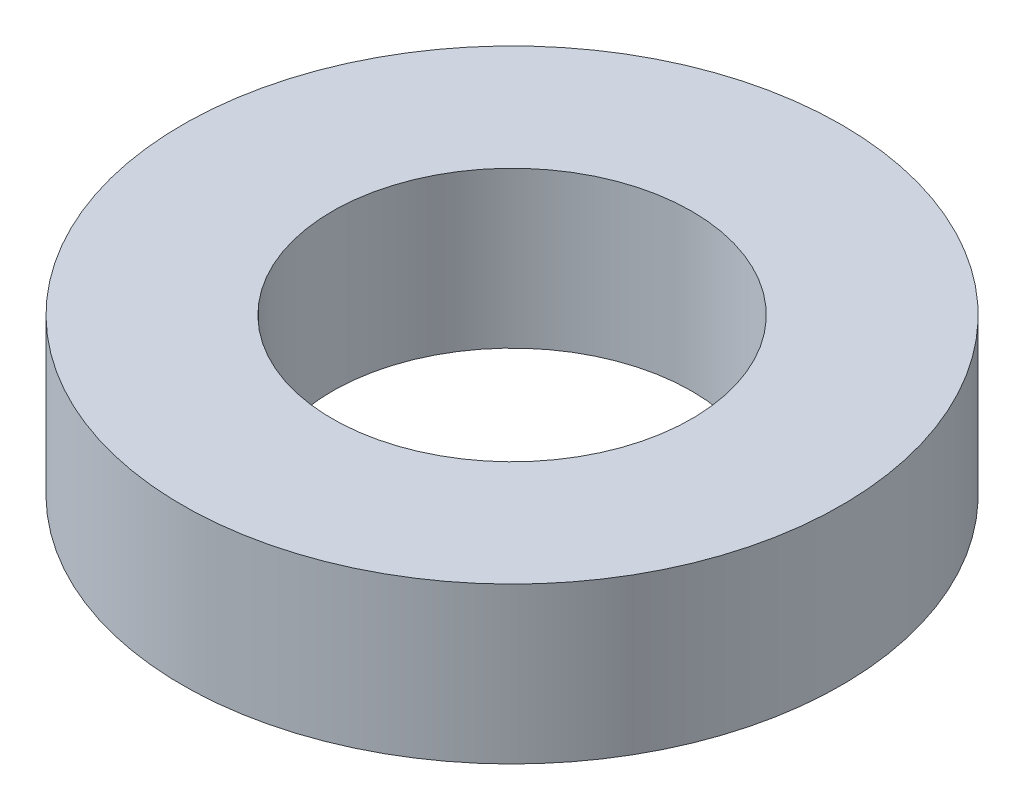
ISO-10303-21;
HEADER;
FILE_DESCRIPTION(('STEP AP214'),'2;1');
FILE_NAME('part.step','',(''),(''),'','','');
FILE_SCHEMA(('AUTOMOTIVE_DESIGN { 1 0 10303 214 1 1 1 1 }'));
ENDSEC;
DATA;
#1=APPLICATION_CONTEXT('core data for automotive mechanical design processes');
#2=APPLICATION_PROTOCOL_DEFINITION('international standard','automotive_design',2000,#1);
#3=PRODUCT_CONTEXT('',#1,'mechanical');
#4=PRODUCT('Part','Part','',(#3));
#5=PRODUCT_RELATED_PRODUCT_CATEGORY('part','',(#4));
#6=PRODUCT_DEFINITION_FORMATION('','',#4);
#7=PRODUCT_DEFINITION_CONTEXT('part definition',#1,'design');
#8=PRODUCT_DEFINITION('design','',#6,#7);
#9=PRODUCT_DEFINITION_SHAPE('','',#8);
#10=(LENGTH_UNIT() NAMED_UNIT(*) SI_UNIT(.MILLI.,.METRE.));
#11=(NAMED_UNIT(*) PLANE_ANGLE_UNIT() SI_UNIT($,.RADIAN.));
#12=(NAMED_UNIT(*) SI_UNIT($,.STERADIAN.) SOLID_ANGLE_UNIT());
#13=UNCERTAINTY_MEASURE_WITH_UNIT(LENGTH_MEASURE(1.E-05),#10,'distance_accuracy_value','');
#14=(GEOMETRIC_REPRESENTATION_CONTEXT(3) GLOBAL_UNCERTAINTY_ASSIGNED_CONTEXT((#13)) GLOBAL_UNIT_ASSIGNED_CONTEXT((#10,
#11,#12)) REPRESENTATION_CONTEXT('',''));
#15=CARTESIAN_POINT('',(0.,0.,0.));
#16=DIRECTION('',(0.,0.,1.));
#17=DIRECTION('',(1.,0.,0.));
#18=AXIS2_PLACEMENT_3D('',#15,#16,#17);
#19=CARTESIAN_POINT('',(0.,13.,0.));
#20=DIRECTION('',(0.,-1.,0.));
#21=DIRECTION('',(0.,0.,-1.));
#22=AXIS2_PLACEMENT_3D('',#19,#20,#21);
#23=CYLINDRICAL_SURFACE('',#22,27.5);
#24=CARTESIAN_POINT('',(0.,13.,0.));
#25=DIRECTION('',(0.,1.,0.));
#26=DIRECTION('',(0.,0.,1.));
#27=AXIS2_PLACEMENT_3D('',#24,#25,#26);
#28=CIRCLE('',#27,27.5);
#29=CARTESIAN_POINT('',(0.,13.,-27.5));
#30=VERTEX_POINT('',#29);
#31=EDGE_CURVE('E10',#30,#30,#28,.T.);
#32=CARTESIAN_POINT('',(0.,0.,0.));
#33=DIRECTION('',(0.,1.,0.));
#34=DIRECTION('',(0.,0.,1.));
#35=AXIS2_PLACEMENT_3D('',#32,#33,#34);
#36=CIRCLE('',#35,27.5);
#37=CARTESIAN_POINT('',(0.,0.,-27.5));
#38=VERTEX_POINT('',#37);
#39=EDGE_CURVE('E37',#38,#38,#36,.T.);
#40=CARTESIAN_POINT('',(0.,13.,-27.5));
#41=CARTESIAN_POINT('',(0.,12.8645833333333,-27.5));
#42=CARTESIAN_POINT('',(0.,12.7291666666667,-27.5));
#43=CARTESIAN_POINT('',(0.,12.4583333333333,-27.5));
#44=CARTESIAN_POINT('',(0.,12.3229166666667,-27.5));
#45=CARTESIAN_POINT('',(0.,12.0520833333333,-27.5));
#46=CARTESIAN_POINT('',(0.,11.9166666666667,-27.5));
#47=CARTESIAN_POINT('',(0.,11.6458333333333,-27.5));
#48=CARTESIAN_POINT('',(0.,11.5104166666667,-27.5));
#49=CARTESIAN_POINT('',(0.,11.2395833333333,-27.5));
#50=CARTESIAN_POINT('',(0.,11.1041666666667,-27.5));
#51=CARTESIAN_POINT('',(0.,10.8333333333333,-27.5));
#52=CARTESIAN_POINT('',(0.,10.6979166666667,-27.5));
#53=CARTESIAN_POINT('',(0.,10.4270833333333,-27.5));
#54=CARTESIAN_POINT('',(0.,10.2916666666667,-27.5));
#55=CARTESIAN_POINT('',(0.,10.0208333333333,-27.5));
#56=CARTESIAN_POINT('',(0.,9.88541666666667,-27.5));
#57=CARTESIAN_POINT('',(0.,9.61458333333333,-27.5));
#58=CARTESIAN_POINT('',(0.,9.47916666666667,-27.5));
#59=CARTESIAN_POINT('',(0.,9.20833333333333,-27.5));
#60=CARTESIAN_POINT('',(0.,9.07291666666666,-27.5));
#61=CARTESIAN_POINT('',(0.,8.80208333333333,-27.5));
#62=CARTESIAN_POINT('',(0.,8.66666666666667,-27.5));
#63=CARTESIAN_POINT('',(0.,8.39583333333333,-27.5));
#64=CARTESIAN_POINT('',(0.,8.26041666666667,-27.5));
#65=CARTESIAN_POINT('',(0.,7.98958333333333,-27.5));
#66=CARTESIAN_POINT('',(0.,7.85416666666667,-27.5));
#67=CARTESIAN_POINT('',(0.,7.58333333333333,-27.5));
#68=CARTESIAN_POINT('',(0.,7.44791666666667,-27.5));
#69=CARTESIAN_POINT('',(0.,7.17708333333333,-27.5));
#70=CARTESIAN_POINT('',(0.,7.04166666666667,-27.5));
#71=CARTESIAN_POINT('',(0.,6.77083333333333,-27.5));
#72=CARTESIAN_POINT('',(0.,6.63541666666667,-27.5));
#73=CARTESIAN_POINT('',(0.,6.36458333333333,-27.5));
#74=CARTESIAN_POINT('',(0.,6.22916666666667,-27.5));
#75=CARTESIAN_POINT('',(0.,5.95833333333333,-27.5));
#76=CARTESIAN_POINT('',(0.,5.82291666666667,-27.5));
#77=CARTESIAN_POINT('',(0.,5.55208333333333,-27.5));
#78=CARTESIAN_POINT('',(0.,5.41666666666667,-27.5));
#79=CARTESIAN_POINT('',(0.,5.14583333333333,-27.5));
#80=CARTESIAN_POINT('',(0.,5.01041666666667,-27.5));
#81=CARTESIAN_POINT('',(0.,4.73958333333333,-27.5));
#82=CARTESIAN_POINT('',(0.,4.60416666666667,-27.5));
#83=CARTESIAN_POINT('',(0.,4.33333333333333,-27.5));
#84=CARTESIAN_POINT('',(0.,4.19791666666667,-27.5));
#85=CARTESIAN_POINT('',(0.,3.92708333333333,-27.5));
#86=CARTESIAN_POINT('',(0.,3.79166666666667,-27.5));
#87=CARTESIAN_POINT('',(0.,3.52083333333333,-27.5));
#88=CARTESIAN_POINT('',(0.,3.38541666666667,-27.5));
#89=CARTESIAN_POINT('',(0.,3.11458333333333,-27.5));
#90=CARTESIAN_POINT('',(0.,2.97916666666667,-27.5));
#91=CARTESIAN_POINT('',(0.,2.70833333333333,-27.5));
#92=CARTESIAN_POINT('',(0.,2.57291666666667,-27.5));
#93=CARTESIAN_POINT('',(0.,2.30208333333333,-27.5));
#94=CARTESIAN_POINT('',(0.,2.16666666666667,-27.5));
#95=CARTESIAN_POINT('',(0.,1.89583333333333,-27.5));
#96=CARTESIAN_POINT('',(0.,1.76041666666667,-27.5));
#97=CARTESIAN_POINT('',(0.,1.48958333333333,-27.5));
#98=CARTESIAN_POINT('',(0.,1.35416666666667,-27.5));
#99=CARTESIAN_POINT('',(0.,1.08333333333333,-27.5));
#100=CARTESIAN_POINT('',(0.,0.947916666666667,-27.5));
#101=CARTESIAN_POINT('',(0.,0.677083333333334,-27.5));
#102=CARTESIAN_POINT('',(0.,0.541666666666667,-27.5));
#103=CARTESIAN_POINT('',(0.,0.270833333333334,-27.5));
#104=CARTESIAN_POINT('',(0.,0.135416666666667,-27.5));
#105=CARTESIAN_POINT('',(0.,0.,-27.5));
#106=B_SPLINE_CURVE_WITH_KNOTS('',3,(#40,#41,#42,#43,#44,#45,#46,#47,#48,#49,#50,#51,#52,#53,
#54,#55,#56,#57,#58,#59,#60,#61,#62,#63,#64,#65,#66,#67,#68,#69,#70,#71,#72,#73,#74,#75,#76,#77,
#78,#79,#80,#81,#82,#83,#84,#85,#86,#87,#88,#89,#90,#91,#92,#93,#94,#95,#96,#97,#98,#99,#100,
#101,#102,#103,#104,#105),.UNSPECIFIED.,.F.,.F.,(4,2,2,2,2,2,2,2,2,2,2,2,2,2,2,2,2,2,2,2,2,2,2,
2,2,2,2,2,2,2,2,2,4),(0.,0.40625,0.812500000000001,1.21875,1.625,2.03125,2.4375,2.84375,3.25,
3.65625,4.0625,4.46875,4.875,5.28125,5.6875,6.09375,6.5,6.90625,7.3125,7.71875,8.125,8.53125,
8.9375,9.34375,9.75,10.15625,10.5625,10.96875,11.375,11.78125,12.1875,12.59375,13.),.UNSPECIFIED.);
#107=EDGE_CURVE('BSEAM40',#30,#38,#106,.T.);
#108=ORIENTED_EDGE('',*,*,#31,.F.);
#109=ORIENTED_EDGE('',*,*,#39,.T.);
#110=ORIENTED_EDGE('',*,*,#107,.T.);
#111=ORIENTED_EDGE('',*,*,#107,.F.);
#112=EDGE_LOOP('',(#108,#110,#109,#111));
#113=FACE_BOUND('',#112,.T.);
#114=ADVANCED_FACE('F40',(#113),#23,.T.);
#115=CARTESIAN_POINT('',(0.,13.,0.));
#116=DIRECTION('',(0.,1.,0.));
#117=DIRECTION('',(0.,0.,1.));
#118=AXIS2_PLACEMENT_3D('',#115,#116,#117);
#119=PLANE('',#118);
#120=CARTESIAN_POINT('',(0.,13.,0.));
#121=DIRECTION('',(0.,1.,0.));
#122=DIRECTION('',(0.,0.,1.));
#123=AXIS2_PLACEMENT_3D('',#120,#121,#122);
#124=CIRCLE('',#123,15.);
#125=CARTESIAN_POINT('',(0.,13.,-15.));
#126=VERTEX_POINT('',#125);
#127=EDGE_CURVE('E50',#126,#126,#124,.T.);
#128=ORIENTED_EDGE('',*,*,#127,.F.);
#129=EDGE_LOOP('',(#128));
#130=FACE_BOUND('',#129,.T.);
#131=ORIENTED_EDGE('',*,*,#31,.T.);
#132=EDGE_LOOP('',(#131));
#133=FACE_BOUND('',#132,.T.);
#134=ADVANCED_FACE('F59',(#130,#133),#119,.T.);
#135=CARTESIAN_POINT('',(0.,0.,0.));
#136=DIRECTION('',(0.,1.,0.));
#137=DIRECTION('',(0.,0.,1.));
#138=AXIS2_PLACEMENT_3D('',#135,#136,#137);
#139=PLANE('',#138);
#140=CARTESIAN_POINT('',(0.,0.,0.));
#141=DIRECTION('',(0.,1.,0.));
#142=DIRECTION('',(0.,0.,1.));
#143=AXIS2_PLACEMENT_3D('',#140,#141,#142);
#144=CIRCLE('',#143,15.);
#145=CARTESIAN_POINT('',(0.,0.,-15.));
#146=VERTEX_POINT('',#145);
#147=EDGE_CURVE('E47',#146,#146,#144,.T.);
#148=ORIENTED_EDGE('',*,*,#147,.T.);
#149=EDGE_LOOP('',(#148));
#150=FACE_BOUND('',#149,.T.);
#151=ORIENTED_EDGE('',*,*,#39,.F.);
#152=EDGE_LOOP('',(#151));
#153=FACE_BOUND('',#152,.T.);
#154=ADVANCED_FACE('F58',(#150,#153),#139,.F.);
#155=CARTESIAN_POINT('',(0.,13.,0.));
#156=DIRECTION('',(0.,-1.,0.));
#157=DIRECTION('',(0.,0.,-1.));
#158=AXIS2_PLACEMENT_3D('',#155,#156,#157);
#159=CYLINDRICAL_SURFACE('',#158,15.);
#160=CARTESIAN_POINT('',(0.,13.,-15.));
#161=CARTESIAN_POINT('',(0.,12.8645833333333,-15.));
#162=CARTESIAN_POINT('',(0.,12.7291666666667,-15.));
#163=CARTESIAN_POINT('',(0.,12.4583333333333,-15.));
#164=CARTESIAN_POINT('',(0.,12.3229166666667,-15.));
#165=CARTESIAN_POINT('',(0.,12.0520833333333,-15.));
#166=CARTESIAN_POINT('',(0.,11.9166666666667,-15.));
#167=CARTESIAN_POINT('',(0.,11.6458333333333,-15.));
#168=CARTESIAN_POINT('',(0.,11.5104166666667,-15.));
#169=CARTESIAN_POINT('',(0.,11.2395833333333,-15.));
#170=CARTESIAN_POINT('',(0.,11.1041666666667,-15.));
#171=CARTESIAN_POINT('',(0.,10.8333333333333,-15.));
#172=CARTESIAN_POINT('',(0.,10.6979166666667,-15.));
#173=CARTESIAN_POINT('',(0.,10.4270833333333,-15.));
#174=CARTESIAN_POINT('',(0.,10.2916666666667,-15.));
#175=CARTESIAN_POINT('',(0.,10.0208333333333,-15.));
#176=CARTESIAN_POINT('',(0.,9.88541666666667,-15.));
#177=CARTESIAN_POINT('',(0.,9.61458333333333,-15.));
#178=CARTESIAN_POINT('',(0.,9.47916666666667,-15.));
#179=CARTESIAN_POINT('',(0.,9.20833333333333,-15.));
#180=CARTESIAN_POINT('',(0.,9.07291666666666,-15.));
#181=CARTESIAN_POINT('',(0.,8.80208333333333,-15.));
#182=CARTESIAN_POINT('',(0.,8.66666666666667,-15.));
#183=CARTESIAN_POINT('',(0.,8.39583333333333,-15.));
#184=CARTESIAN_POINT('',(0.,8.26041666666667,-15.));
#185=CARTESIAN_POINT('',(0.,7.98958333333333,-15.));
#186=CARTESIAN_POINT('',(0.,7.85416666666667,-15.));
#187=CARTESIAN_POINT('',(0.,7.58333333333333,-15.));
#188=CARTESIAN_POINT('',(0.,7.44791666666667,-15.));
#189=CARTESIAN_POINT('',(0.,7.17708333333333,-15.));
#190=CARTESIAN_POINT('',(0.,7.04166666666667,-15.));
#191=CARTESIAN_POINT('',(0.,6.77083333333333,-15.));
#192=CARTESIAN_POINT('',(0.,6.63541666666667,-15.));
#193=CARTESIAN_POINT('',(0.,6.36458333333333,-15.));
#194=CARTESIAN_POINT('',(0.,6.22916666666667,-15.));
#195=CARTESIAN_POINT('',(0.,5.95833333333333,-15.));
#196=CARTESIAN_POINT('',(0.,5.82291666666667,-15.));
#197=CARTESIAN_POINT('',(0.,5.55208333333333,-15.));
#198=CARTESIAN_POINT('',(0.,5.41666666666667,-15.));
#199=CARTESIAN_POINT('',(0.,5.14583333333333,-15.));
#200=CARTESIAN_POINT('',(0.,5.01041666666667,-15.));
#201=CARTESIAN_POINT('',(0.,4.73958333333333,-15.));
#202=CARTESIAN_POINT('',(0.,4.60416666666667,-15.));
#203=CARTESIAN_POINT('',(0.,4.33333333333333,-15.));
#204=CARTESIAN_POINT('',(0.,4.19791666666667,-15.));
#205=CARTESIAN_POINT('',(0.,3.92708333333333,-15.));
#206=CARTESIAN_POINT('',(0.,3.79166666666667,-15.));
#207=CARTESIAN_POINT('',(0.,3.52083333333333,-15.));
#208=CARTESIAN_POINT('',(0.,3.38541666666667,-15.));
#209=CARTESIAN_POINT('',(0.,3.11458333333333,-15.));
#210=CARTESIAN_POINT('',(0.,2.97916666666667,-15.));
#211=CARTESIAN_POINT('',(0.,2.70833333333333,-15.));
#212=CARTESIAN_POINT('',(0.,2.57291666666667,-15.));
#213=CARTESIAN_POINT('',(0.,2.30208333333333,-15.));
#214=CARTESIAN_POINT('',(0.,2.16666666666667,-15.));
#215=CARTESIAN_POINT('',(0.,1.89583333333333,-15.));
#216=CARTESIAN_POINT('',(0.,1.76041666666667,-15.));
#217=CARTESIAN_POINT('',(0.,1.48958333333333,-15.));
#218=CARTESIAN_POINT('',(0.,1.35416666666667,-15.));
#219=CARTESIAN_POINT('',(0.,1.08333333333333,-15.));
#220=CARTESIAN_POINT('',(0.,0.947916666666667,-15.));
#221=CARTESIAN_POINT('',(0.,0.677083333333334,-15.));
#222=CARTESIAN_POINT('',(0.,0.541666666666667,-15.));
#223=CARTESIAN_POINT('',(0.,0.270833333333334,-15.));
#224=CARTESIAN_POINT('',(0.,0.135416666666667,-15.));
#225=CARTESIAN_POINT('',(0.,0.,-15.));
#226=B_SPLINE_CURVE_WITH_KNOTS('',3,(#160,#161,#162,#163,#164,#165,#166,#167,#168,#169,#170,
#171,#172,#173,#174,#175,#176,#177,#178,#179,#180,#181,#182,#183,#184,#185,#186,#187,#188,#189,
#190,#191,#192,#193,#194,#195,#196,#197,#198,#199,#200,#201,#202,#203,#204,#205,#206,#207,#208,
#209,#210,#211,#212,#213,#214,#215,#216,#217,#218,#219,#220,#221,#222,#223,#224,#225),
.UNSPECIFIED.,.F.,.F.,(4,2,2,2,2,2,2,2,2,2,2,2,2,2,2,2,2,2,2,2,2,2,2,2,2,2,2,2,2,2,2,2,4),(0.,
0.40625,0.812500000000001,1.21875,1.625,2.03125,2.4375,2.84375,3.25,3.65625,4.0625,4.46875,
4.875,5.28125,5.6875,6.09375,6.5,6.90625,7.3125,7.71875,8.125,8.53125,8.9375,9.34375,9.75,
10.15625,10.5625,10.96875,11.375,11.78125,12.1875,12.59375,13.),.UNSPECIFIED.);
#227=EDGE_CURVE('BSEAM54',#126,#146,#226,.T.);
#228=ORIENTED_EDGE('',*,*,#127,.T.);
#229=ORIENTED_EDGE('',*,*,#147,.F.);
#230=ORIENTED_EDGE('',*,*,#227,.T.);
#231=ORIENTED_EDGE('',*,*,#227,.F.);
#232=EDGE_LOOP('',(#228,#230,#229,#231));
#233=FACE_BOUND('',#232,.T.);
#234=ADVANCED_FACE('F54',(#233),#159,.F.);
#235=CLOSED_SHELL('',(#114,#134,#154,#234));
#236=MANIFOLD_SOLID_BREP('B2',#235);
#237=ADVANCED_BREP_SHAPE_REPRESENTATION('',(#18,#236),#14);
#238=SHAPE_DEFINITION_REPRESENTATION(#9,#237);
ENDSEC;
END-ISO-10303-21;
